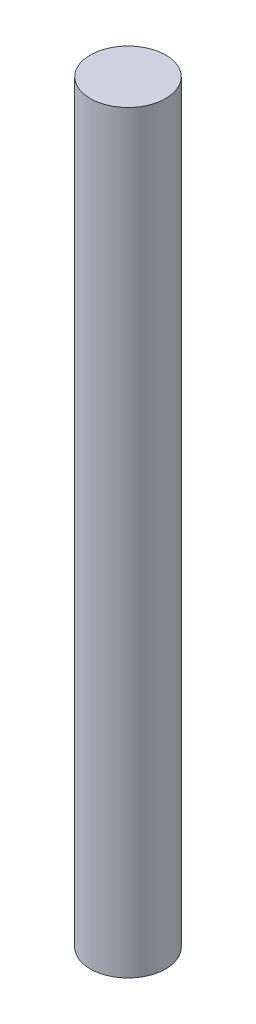
ISO-10303-21;
HEADER;
FILE_DESCRIPTION(('STEP AP214'),'2;1');
FILE_NAME('part.step','',(''),(''),'','','');
FILE_SCHEMA(('AUTOMOTIVE_DESIGN { 1 0 10303 214 1 1 1 1 }'));
ENDSEC;
DATA;
#1=APPLICATION_CONTEXT('core data for automotive mechanical design processes');
#2=APPLICATION_PROTOCOL_DEFINITION('international standard','automotive_design',2000,#1);
#3=PRODUCT_CONTEXT('',#1,'mechanical');
#4=PRODUCT('Part','Part','',(#3));
#5=PRODUCT_RELATED_PRODUCT_CATEGORY('part','',(#4));
#6=PRODUCT_DEFINITION_FORMATION('','',#4);
#7=PRODUCT_DEFINITION_CONTEXT('part definition',#1,'design');
#8=PRODUCT_DEFINITION('design','',#6,#7);
#9=PRODUCT_DEFINITION_SHAPE('','',#8);
#10=(LENGTH_UNIT() NAMED_UNIT(*) SI_UNIT(.MILLI.,.METRE.));
#11=(NAMED_UNIT(*) PLANE_ANGLE_UNIT() SI_UNIT($,.RADIAN.));
#12=(NAMED_UNIT(*) SI_UNIT($,.STERADIAN.) SOLID_ANGLE_UNIT());
#13=UNCERTAINTY_MEASURE_WITH_UNIT(LENGTH_MEASURE(1.E-05),#10,'distance_accuracy_value','');
#14=(GEOMETRIC_REPRESENTATION_CONTEXT(3) GLOBAL_UNCERTAINTY_ASSIGNED_CONTEXT((#13)) GLOBAL_UNIT_ASSIGNED_CONTEXT((#10,
#11,#12)) REPRESENTATION_CONTEXT('',''));
#15=CARTESIAN_POINT('',(0.,0.,0.));
#16=DIRECTION('',(0.,0.,1.));
#17=DIRECTION('',(1.,0.,0.));
#18=AXIS2_PLACEMENT_3D('',#15,#16,#17);
#19=CARTESIAN_POINT('',(0.,2.,0.));
#20=DIRECTION('',(0.,-1.,0.));
#21=DIRECTION('',(0.,0.,-1.));
#22=AXIS2_PLACEMENT_3D('',#19,#20,#21);
#23=CYLINDRICAL_SURFACE('',#22,0.1);
#24=CARTESIAN_POINT('',(0.,2.,0.));
#25=DIRECTION('',(0.,1.,0.));
#26=DIRECTION('',(0.,0.,1.));
#27=AXIS2_PLACEMENT_3D('',#24,#25,#26);
#28=CIRCLE('',#27,0.1);
#29=CARTESIAN_POINT('',(0.,2.,0.1));
#30=VERTEX_POINT('',#29);
#31=EDGE_CURVE('E10',#30,#30,#28,.T.);
#32=ORIENTED_EDGE('',*,*,#31,.F.);
#33=EDGE_LOOP('',(#32));
#34=FACE_BOUND('',#33,.T.);
#35=CARTESIAN_POINT('',(0.,0.,0.));
#36=DIRECTION('',(0.,1.,0.));
#37=DIRECTION('',(0.,0.,1.));
#38=AXIS2_PLACEMENT_3D('',#35,#36,#37);
#39=CIRCLE('',#38,0.1);
#40=CARTESIAN_POINT('',(0.,0.,0.1));
#41=VERTEX_POINT('',#40);
#42=EDGE_CURVE('E40',#41,#41,#39,.T.);
#43=ORIENTED_EDGE('',*,*,#42,.T.);
#44=EDGE_LOOP('',(#43));
#45=FACE_BOUND('',#44,.T.);
#46=ADVANCED_FACE('F37',(#34,#45),#23,.T.);
#47=CARTESIAN_POINT('',(0.,2.,0.));
#48=DIRECTION('',(0.,1.,0.));
#49=DIRECTION('',(0.,0.,1.));
#50=AXIS2_PLACEMENT_3D('',#47,#48,#49);
#51=PLANE('',#50);
#52=ORIENTED_EDGE('',*,*,#31,.T.);
#53=EDGE_LOOP('',(#52));
#54=FACE_BOUND('',#53,.T.);
#55=ADVANCED_FACE('F54',(#54),#51,.T.);
#56=CARTESIAN_POINT('',(0.,0.,0.));
#57=DIRECTION('',(0.,1.,0.));
#58=DIRECTION('',(0.,0.,1.));
#59=AXIS2_PLACEMENT_3D('',#56,#57,#58);
#60=PLANE('',#59);
#61=ORIENTED_EDGE('',*,*,#42,.F.);
#62=EDGE_LOOP('',(#61));
#63=FACE_BOUND('',#62,.T.);
#64=ADVANCED_FACE('F52',(#63),#60,.F.);
#65=CLOSED_SHELL('',(#46,#55,#64));
#66=MANIFOLD_SOLID_BREP('B2',#65);
#67=ADVANCED_BREP_SHAPE_REPRESENTATION('',(#18,#66),#14);
#68=SHAPE_DEFINITION_REPRESENTATION(#9,#67);
ENDSEC;
END-ISO-10303-21;
